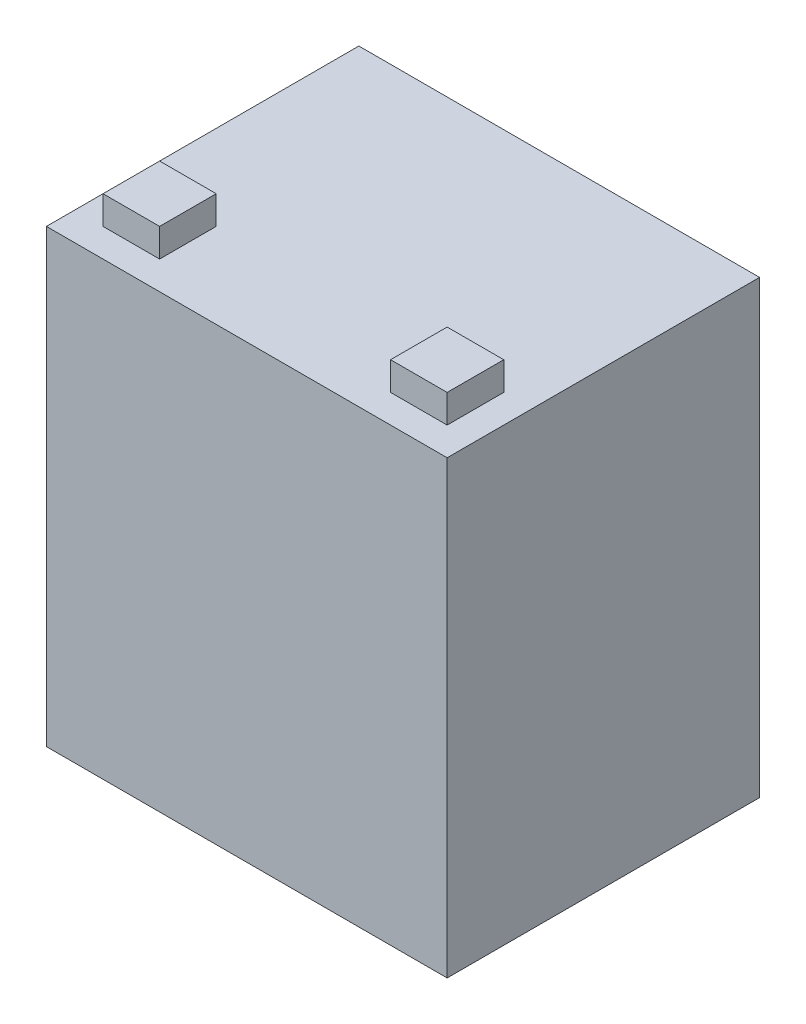
ISO-10303-21;
HEADER;
FILE_DESCRIPTION(('STEP AP214'),'2;1');
FILE_NAME('part.step','',(''),(''),'','','');
FILE_SCHEMA(('AUTOMOTIVE_DESIGN { 1 0 10303 214 1 1 1 1 }'));
ENDSEC;
DATA;
#1=APPLICATION_CONTEXT('core data for automotive mechanical design processes');
#2=APPLICATION_PROTOCOL_DEFINITION('international standard','automotive_design',2000,#1);
#3=PRODUCT_CONTEXT('',#1,'mechanical');
#4=PRODUCT('Part','Part','',(#3));
#5=PRODUCT_RELATED_PRODUCT_CATEGORY('part','',(#4));
#6=PRODUCT_DEFINITION_FORMATION('','',#4);
#7=PRODUCT_DEFINITION_CONTEXT('part definition',#1,'design');
#8=PRODUCT_DEFINITION('design','',#6,#7);
#9=PRODUCT_DEFINITION_SHAPE('','',#8);
#10=(LENGTH_UNIT() NAMED_UNIT(*) SI_UNIT(.MILLI.,.METRE.));
#11=(NAMED_UNIT(*) PLANE_ANGLE_UNIT() SI_UNIT($,.RADIAN.));
#12=(NAMED_UNIT(*) SI_UNIT($,.STERADIAN.) SOLID_ANGLE_UNIT());
#13=UNCERTAINTY_MEASURE_WITH_UNIT(LENGTH_MEASURE(1.E-05),#10,'distance_accuracy_value','');
#14=(GEOMETRIC_REPRESENTATION_CONTEXT(3) GLOBAL_UNCERTAINTY_ASSIGNED_CONTEXT((#13)) GLOBAL_UNIT_ASSIGNED_CONTEXT((#10,
#11,#12)) REPRESENTATION_CONTEXT('',''));
#15=CARTESIAN_POINT('',(0.,0.,0.));
#16=DIRECTION('',(0.,0.,1.));
#17=DIRECTION('',(1.,0.,0.));
#18=AXIS2_PLACEMENT_3D('',#15,#16,#17);
#19=CARTESIAN_POINT('',(0.,101.092,0.));
#20=DIRECTION('',(0.,-1.,0.));
#21=DIRECTION('',(0.,0.,-1.));
#22=AXIS2_PLACEMENT_3D('',#19,#20,#21);
#23=PLANE('',#22);
#24=DIRECTION('',(0.,0.,-1.));
#25=VECTOR('',#24,1.);
#26=CARTESIAN_POINT('',(-25.908,101.092,28.702));
#27=LINE('',#26,#25);
#28=CARTESIAN_POINT('',(-25.908,101.092,28.702));
#29=VERTEX_POINT('',#28);
#30=CARTESIAN_POINT('',(-25.908,101.092,16.002));
#31=VERTEX_POINT('',#30);
#32=EDGE_CURVE('E143',#29,#31,#27,.T.);
#33=ORIENTED_EDGE('',*,*,#32,.F.);
#34=DIRECTION('',(1.,0.,0.));
#35=VECTOR('',#34,1.);
#36=CARTESIAN_POINT('',(-38.608,101.092,28.702));
#37=LINE('',#36,#35);
#38=CARTESIAN_POINT('',(-38.608,101.092,28.702));
#39=VERTEX_POINT('',#38);
#40=EDGE_CURVE('E156',#39,#29,#37,.T.);
#41=ORIENTED_EDGE('',*,*,#40,.F.);
#42=DIRECTION('',(0.,0.,1.));
#43=VECTOR('',#42,1.);
#44=CARTESIAN_POINT('',(-38.608,101.092,28.702));
#45=LINE('',#44,#43);
#46=CARTESIAN_POINT('',(-38.608,101.092,16.002));
#47=VERTEX_POINT('',#46);
#48=EDGE_CURVE('E165',#47,#39,#45,.T.);
#49=ORIENTED_EDGE('',*,*,#48,.F.);
#50=DIRECTION('',(-1.,0.,0.));
#51=VECTOR('',#50,1.);
#52=CARTESIAN_POINT('',(-38.608,101.092,16.002));
#53=LINE('',#52,#51);
#54=EDGE_CURVE('E146',#31,#47,#53,.T.);
#55=ORIENTED_EDGE('',*,*,#54,.F.);
#56=EDGE_LOOP('',(#33,#41,#49,#55));
#57=FACE_BOUND('',#56,.T.);
#58=DIRECTION('',(0.,0.,-1.));
#59=VECTOR('',#58,1.);
#60=CARTESIAN_POINT('',(44.958,101.092,35.052));
#61=LINE('',#60,#59);
#62=CARTESIAN_POINT('',(44.958,101.092,35.052));
#63=VERTEX_POINT('',#62);
#64=CARTESIAN_POINT('',(44.958,101.092,-35.052));
#65=VERTEX_POINT('',#64);
#66=EDGE_CURVE('E182',#63,#65,#61,.T.);
#67=ORIENTED_EDGE('',*,*,#66,.T.);
#68=DIRECTION('',(-1.,0.,0.));
#69=VECTOR('',#68,1.);
#70=CARTESIAN_POINT('',(-44.958,101.092,-35.052));
#71=LINE('',#70,#69);
#72=CARTESIAN_POINT('',(-44.958,101.092,-35.052));
#73=VERTEX_POINT('',#72);
#74=EDGE_CURVE('E185',#65,#73,#71,.T.);
#75=ORIENTED_EDGE('',*,*,#74,.T.);
#76=DIRECTION('',(0.,0.,1.));
#77=VECTOR('',#76,1.);
#78=CARTESIAN_POINT('',(-44.958,101.092,35.052));
#79=LINE('',#78,#77);
#80=CARTESIAN_POINT('',(-44.958,101.092,35.052));
#81=VERTEX_POINT('',#80);
#82=EDGE_CURVE('E188',#73,#81,#79,.T.);
#83=ORIENTED_EDGE('',*,*,#82,.T.);
#84=DIRECTION('',(1.,0.,0.));
#85=VECTOR('',#84,1.);
#86=CARTESIAN_POINT('',(-44.958,101.092,35.052));
#87=LINE('',#86,#85);
#88=EDGE_CURVE('E190',#81,#63,#87,.T.);
#89=ORIENTED_EDGE('',*,*,#88,.T.);
#90=EDGE_LOOP('',(#67,#75,#83,#89));
#91=FACE_BOUND('',#90,.T.);
#92=DIRECTION('',(-1.,0.,0.));
#93=VECTOR('',#92,1.);
#94=CARTESIAN_POINT('',(38.608,101.092,16.0019999999999));
#95=LINE('',#94,#93);
#96=CARTESIAN_POINT('',(38.608,101.092,16.0019999999999));
#97=VERTEX_POINT('',#96);
#98=CARTESIAN_POINT('',(25.908,101.092,16.0019999999999));
#99=VERTEX_POINT('',#98);
#100=EDGE_CURVE('E142',#97,#99,#95,.T.);
#101=ORIENTED_EDGE('',*,*,#100,.F.);
#102=DIRECTION('',(0.,0.,-1.));
#103=VECTOR('',#102,1.);
#104=CARTESIAN_POINT('',(38.608,101.092,28.7019999999999));
#105=LINE('',#104,#103);
#106=CARTESIAN_POINT('',(38.608,101.092,28.7019999999999));
#107=VERTEX_POINT('',#106);
#108=EDGE_CURVE('E139',#107,#97,#105,.T.);
#109=ORIENTED_EDGE('',*,*,#108,.F.);
#110=DIRECTION('',(1.,0.,0.));
#111=VECTOR('',#110,1.);
#112=CARTESIAN_POINT('',(38.608,101.092,28.7019999999999));
#113=LINE('',#112,#111);
#114=CARTESIAN_POINT('',(25.908,101.092,28.7019999999999));
#115=VERTEX_POINT('',#114);
#116=EDGE_CURVE('E53',#115,#107,#113,.T.);
#117=ORIENTED_EDGE('',*,*,#116,.F.);
#118=DIRECTION('',(0.,0.,1.));
#119=VECTOR('',#118,1.);
#120=CARTESIAN_POINT('',(25.908,101.092,28.7019999999999));
#121=LINE('',#120,#119);
#122=EDGE_CURVE('E48',#99,#115,#121,.T.);
#123=ORIENTED_EDGE('',*,*,#122,.F.);
#124=EDGE_LOOP('',(#101,#109,#117,#123));
#125=FACE_BOUND('',#124,.T.);
#126=ADVANCED_FACE('F33',(#57,#91,#125),#23,.F.);
#127=CARTESIAN_POINT('',(44.958,101.092,35.052));
#128=DIRECTION('',(-1.,0.,0.));
#129=DIRECTION('',(0.,0.,1.));
#130=AXIS2_PLACEMENT_3D('',#127,#128,#129);
#131=PLANE('',#130);
#132=DIRECTION('',(0.,0.,-1.));
#133=VECTOR('',#132,1.);
#134=CARTESIAN_POINT('',(44.958,0.,35.052));
#135=LINE('',#134,#133);
#136=CARTESIAN_POINT('',(44.958,0.,35.052));
#137=VERTEX_POINT('',#136);
#138=CARTESIAN_POINT('',(44.958,0.,-35.052));
#139=VERTEX_POINT('',#138);
#140=EDGE_CURVE('E181',#137,#139,#135,.T.);
#141=ORIENTED_EDGE('',*,*,#140,.T.);
#142=DIRECTION('',(0.,-1.,0.));
#143=VECTOR('',#142,1.);
#144=CARTESIAN_POINT('',(44.958,101.092,-35.052));
#145=LINE('',#144,#143);
#146=EDGE_CURVE('E11',#65,#139,#145,.T.);
#147=ORIENTED_EDGE('',*,*,#146,.F.);
#148=ORIENTED_EDGE('',*,*,#66,.F.);
#149=DIRECTION('',(0.,-1.,0.));
#150=VECTOR('',#149,1.);
#151=CARTESIAN_POINT('',(44.958,101.092,35.052));
#152=LINE('',#151,#150);
#153=EDGE_CURVE('E192',#63,#137,#152,.T.);
#154=ORIENTED_EDGE('',*,*,#153,.T.);
#155=EDGE_LOOP('',(#141,#147,#148,#154));
#156=FACE_BOUND('',#155,.T.);
#157=ADVANCED_FACE('F35',(#156),#131,.F.);
#158=CARTESIAN_POINT('',(-44.958,101.092,-35.052));
#159=DIRECTION('',(0.,0.,1.));
#160=DIRECTION('',(1.,0.,0.));
#161=AXIS2_PLACEMENT_3D('',#158,#159,#160);
#162=PLANE('',#161);
#163=DIRECTION('',(-1.,0.,0.));
#164=VECTOR('',#163,1.);
#165=CARTESIAN_POINT('',(-44.958,0.,-35.052));
#166=LINE('',#165,#164);
#167=CARTESIAN_POINT('',(-44.958,0.,-35.052));
#168=VERTEX_POINT('',#167);
#169=EDGE_CURVE('E195',#139,#168,#166,.T.);
#170=ORIENTED_EDGE('',*,*,#169,.T.);
#171=DIRECTION('',(0.,-1.,0.));
#172=VECTOR('',#171,1.);
#173=CARTESIAN_POINT('',(-44.958,101.092,-35.052));
#174=LINE('',#173,#172);
#175=EDGE_CURVE('E41',#73,#168,#174,.T.);
#176=ORIENTED_EDGE('',*,*,#175,.F.);
#177=ORIENTED_EDGE('',*,*,#74,.F.);
#178=ORIENTED_EDGE('',*,*,#146,.T.);
#179=EDGE_LOOP('',(#170,#176,#177,#178));
#180=FACE_BOUND('',#179,.T.);
#181=ADVANCED_FACE('F224',(#180),#162,.F.);
#182=CARTESIAN_POINT('',(-44.958,101.092,35.052));
#183=DIRECTION('',(1.,0.,0.));
#184=DIRECTION('',(0.,0.,-1.));
#185=AXIS2_PLACEMENT_3D('',#182,#183,#184);
#186=PLANE('',#185);
#187=DIRECTION('',(0.,0.,1.));
#188=VECTOR('',#187,1.);
#189=CARTESIAN_POINT('',(-44.958,0.,35.052));
#190=LINE('',#189,#188);
#191=CARTESIAN_POINT('',(-44.958,0.,35.052));
#192=VERTEX_POINT('',#191);
#193=EDGE_CURVE('E197',#168,#192,#190,.T.);
#194=ORIENTED_EDGE('',*,*,#193,.T.);
#195=DIRECTION('',(0.,-1.,0.));
#196=VECTOR('',#195,1.);
#197=CARTESIAN_POINT('',(-44.958,101.092,35.052));
#198=LINE('',#197,#196);
#199=EDGE_CURVE('E202',#81,#192,#198,.T.);
#200=ORIENTED_EDGE('',*,*,#199,.F.);
#201=ORIENTED_EDGE('',*,*,#82,.F.);
#202=ORIENTED_EDGE('',*,*,#175,.T.);
#203=EDGE_LOOP('',(#194,#200,#201,#202));
#204=FACE_BOUND('',#203,.T.);
#205=ADVANCED_FACE('F209',(#204),#186,.F.);
#206=CARTESIAN_POINT('',(-44.958,101.092,35.052));
#207=DIRECTION('',(0.,0.,-1.));
#208=DIRECTION('',(-1.,0.,0.));
#209=AXIS2_PLACEMENT_3D('',#206,#207,#208);
#210=PLANE('',#209);
#211=DIRECTION('',(1.,0.,0.));
#212=VECTOR('',#211,1.);
#213=CARTESIAN_POINT('',(-44.958,0.,35.052));
#214=LINE('',#213,#212);
#215=EDGE_CURVE('E186',#192,#137,#214,.T.);
#216=ORIENTED_EDGE('',*,*,#215,.T.);
#217=ORIENTED_EDGE('',*,*,#153,.F.);
#218=ORIENTED_EDGE('',*,*,#88,.F.);
#219=ORIENTED_EDGE('',*,*,#199,.T.);
#220=EDGE_LOOP('',(#216,#217,#218,#219));
#221=FACE_BOUND('',#220,.T.);
#222=ADVANCED_FACE('F218',(#221),#210,.F.);
#223=CARTESIAN_POINT('',(0.,0.,0.));
#224=DIRECTION('',(0.,-1.,0.));
#225=DIRECTION('',(0.,0.,-1.));
#226=AXIS2_PLACEMENT_3D('',#223,#224,#225);
#227=PLANE('',#226);
#228=ORIENTED_EDGE('',*,*,#140,.F.);
#229=ORIENTED_EDGE('',*,*,#215,.F.);
#230=ORIENTED_EDGE('',*,*,#193,.F.);
#231=ORIENTED_EDGE('',*,*,#169,.F.);
#232=EDGE_LOOP('',(#228,#229,#230,#231));
#233=FACE_BOUND('',#232,.T.);
#234=ADVANCED_FACE('F215',(#233),#227,.T.);
#235=CARTESIAN_POINT('',(-25.908,107.442,28.702));
#236=DIRECTION('',(-1.,0.,0.));
#237=DIRECTION('',(0.,0.,1.));
#238=AXIS2_PLACEMENT_3D('',#235,#236,#237);
#239=PLANE('',#238);
#240=ORIENTED_EDGE('',*,*,#32,.T.);
#241=DIRECTION('',(0.,-1.,0.));
#242=VECTOR('',#241,1.);
#243=CARTESIAN_POINT('',(-25.908,107.442,16.002));
#244=LINE('',#243,#242);
#245=CARTESIAN_POINT('',(-25.908,107.442,16.002));
#246=VERTEX_POINT('',#245);
#247=EDGE_CURVE('E178',#246,#31,#244,.T.);
#248=ORIENTED_EDGE('',*,*,#247,.F.);
#249=DIRECTION('',(0.,0.,-1.));
#250=VECTOR('',#249,1.);
#251=CARTESIAN_POINT('',(-25.908,107.442,28.702));
#252=LINE('',#251,#250);
#253=CARTESIAN_POINT('',(-25.908,107.442,28.702));
#254=VERTEX_POINT('',#253);
#255=EDGE_CURVE('E152',#254,#246,#252,.T.);
#256=ORIENTED_EDGE('',*,*,#255,.F.);
#257=DIRECTION('',(0.,-1.,0.));
#258=VECTOR('',#257,1.);
#259=CARTESIAN_POINT('',(-25.908,107.442,28.702));
#260=LINE('',#259,#258);
#261=EDGE_CURVE('E161',#254,#29,#260,.T.);
#262=ORIENTED_EDGE('',*,*,#261,.T.);
#263=EDGE_LOOP('',(#240,#248,#256,#262));
#264=FACE_BOUND('',#263,.T.);
#265=ADVANCED_FACE('F238',(#264),#239,.F.);
#266=CARTESIAN_POINT('',(-38.608,107.442,16.002));
#267=DIRECTION('',(0.,0.,1.));
#268=DIRECTION('',(1.,0.,0.));
#269=AXIS2_PLACEMENT_3D('',#266,#267,#268);
#270=PLANE('',#269);
#271=ORIENTED_EDGE('',*,*,#54,.T.);
#272=DIRECTION('',(0.,-1.,0.));
#273=VECTOR('',#272,1.);
#274=CARTESIAN_POINT('',(-38.608,107.442,16.002));
#275=LINE('',#274,#273);
#276=CARTESIAN_POINT('',(-38.608,107.442,16.002));
#277=VERTEX_POINT('',#276);
#278=EDGE_CURVE('E175',#277,#47,#275,.T.);
#279=ORIENTED_EDGE('',*,*,#278,.F.);
#280=DIRECTION('',(-1.,0.,0.));
#281=VECTOR('',#280,1.);
#282=CARTESIAN_POINT('',(-38.608,107.442,16.002));
#283=LINE('',#282,#281);
#284=EDGE_CURVE('E155',#246,#277,#283,.T.);
#285=ORIENTED_EDGE('',*,*,#284,.F.);
#286=ORIENTED_EDGE('',*,*,#247,.T.);
#287=EDGE_LOOP('',(#271,#279,#285,#286));
#288=FACE_BOUND('',#287,.T.);
#289=ADVANCED_FACE('F257',(#288),#270,.F.);
#290=CARTESIAN_POINT('',(-38.608,107.442,28.702));
#291=DIRECTION('',(1.,0.,0.));
#292=DIRECTION('',(0.,0.,-1.));
#293=AXIS2_PLACEMENT_3D('',#290,#291,#292);
#294=PLANE('',#293);
#295=ORIENTED_EDGE('',*,*,#48,.T.);
#296=DIRECTION('',(0.,-1.,0.));
#297=VECTOR('',#296,1.);
#298=CARTESIAN_POINT('',(-38.608,107.442,28.702));
#299=LINE('',#298,#297);
#300=CARTESIAN_POINT('',(-38.608,107.442,28.702));
#301=VERTEX_POINT('',#300);
#302=EDGE_CURVE('E172',#301,#39,#299,.T.);
#303=ORIENTED_EDGE('',*,*,#302,.F.);
#304=DIRECTION('',(0.,0.,1.));
#305=VECTOR('',#304,1.);
#306=CARTESIAN_POINT('',(-38.608,107.442,28.702));
#307=LINE('',#306,#305);
#308=EDGE_CURVE('E158',#277,#301,#307,.T.);
#309=ORIENTED_EDGE('',*,*,#308,.F.);
#310=ORIENTED_EDGE('',*,*,#278,.T.);
#311=EDGE_LOOP('',(#295,#303,#309,#310));
#312=FACE_BOUND('',#311,.T.);
#313=ADVANCED_FACE('F264',(#312),#294,.F.);
#314=CARTESIAN_POINT('',(-38.608,107.442,28.702));
#315=DIRECTION('',(0.,0.,-1.));
#316=DIRECTION('',(-1.,0.,0.));
#317=AXIS2_PLACEMENT_3D('',#314,#315,#316);
#318=PLANE('',#317);
#319=ORIENTED_EDGE('',*,*,#40,.T.);
#320=ORIENTED_EDGE('',*,*,#261,.F.);
#321=DIRECTION('',(1.,0.,0.));
#322=VECTOR('',#321,1.);
#323=CARTESIAN_POINT('',(-38.608,107.442,28.702));
#324=LINE('',#323,#322);
#325=EDGE_CURVE('E160',#301,#254,#324,.T.);
#326=ORIENTED_EDGE('',*,*,#325,.F.);
#327=ORIENTED_EDGE('',*,*,#302,.T.);
#328=EDGE_LOOP('',(#319,#320,#326,#327));
#329=FACE_BOUND('',#328,.T.);
#330=ADVANCED_FACE('F271',(#329),#318,.F.);
#331=CARTESIAN_POINT('',(0.,107.442,0.));
#332=DIRECTION('',(0.,-1.,0.));
#333=DIRECTION('',(0.,0.,-1.));
#334=AXIS2_PLACEMENT_3D('',#331,#332,#333);
#335=PLANE('',#334);
#336=ORIENTED_EDGE('',*,*,#255,.T.);
#337=ORIENTED_EDGE('',*,*,#284,.T.);
#338=ORIENTED_EDGE('',*,*,#308,.T.);
#339=ORIENTED_EDGE('',*,*,#325,.T.);
#340=EDGE_LOOP('',(#336,#337,#338,#339));
#341=FACE_BOUND('',#340,.T.);
#342=ADVANCED_FACE('F279',(#341),#335,.F.);
#343=CARTESIAN_POINT('',(38.608,107.442,16.0019999999999));
#344=DIRECTION('',(0.,0.,1.));
#345=DIRECTION('',(1.,0.,0.));
#346=AXIS2_PLACEMENT_3D('',#343,#344,#345);
#347=PLANE('',#346);
#348=ORIENTED_EDGE('',*,*,#100,.T.);
#349=DIRECTION('',(0.,-1.,0.));
#350=VECTOR('',#349,1.);
#351=CARTESIAN_POINT('',(25.908,107.442,16.0019999999999));
#352=LINE('',#351,#350);
#353=CARTESIAN_POINT('',(25.908,107.442,16.0019999999999));
#354=VERTEX_POINT('',#353);
#355=EDGE_CURVE('E123',#354,#99,#352,.T.);
#356=ORIENTED_EDGE('',*,*,#355,.F.);
#357=DIRECTION('',(-1.,0.,0.));
#358=VECTOR('',#357,1.);
#359=CARTESIAN_POINT('',(38.608,107.442,16.0019999999999));
#360=LINE('',#359,#358);
#361=CARTESIAN_POINT('',(38.608,107.442,16.0019999999999));
#362=VERTEX_POINT('',#361);
#363=EDGE_CURVE('E130',#362,#354,#360,.T.);
#364=ORIENTED_EDGE('',*,*,#363,.F.);
#365=DIRECTION('',(0.,-1.,0.));
#366=VECTOR('',#365,1.);
#367=CARTESIAN_POINT('',(38.608,107.442,16.0019999999999));
#368=LINE('',#367,#366);
#369=EDGE_CURVE('E368',#362,#97,#368,.T.);
#370=ORIENTED_EDGE('',*,*,#369,.T.);
#371=EDGE_LOOP('',(#348,#356,#364,#370));
#372=FACE_BOUND('',#371,.T.);
#373=ADVANCED_FACE('F141',(#372),#347,.F.);
#374=CARTESIAN_POINT('',(25.908,107.442,28.7019999999999));
#375=DIRECTION('',(1.,0.,0.));
#376=DIRECTION('',(0.,0.,-1.));
#377=AXIS2_PLACEMENT_3D('',#374,#375,#376);
#378=PLANE('',#377);
#379=ORIENTED_EDGE('',*,*,#122,.T.);
#380=DIRECTION('',(0.,-1.,0.));
#381=VECTOR('',#380,1.);
#382=CARTESIAN_POINT('',(25.908,107.442,28.7019999999999));
#383=LINE('',#382,#381);
#384=CARTESIAN_POINT('',(25.908,107.442,28.7019999999999));
#385=VERTEX_POINT('',#384);
#386=EDGE_CURVE('E126',#385,#115,#383,.T.);
#387=ORIENTED_EDGE('',*,*,#386,.F.);
#388=DIRECTION('',(0.,0.,1.));
#389=VECTOR('',#388,1.);
#390=CARTESIAN_POINT('',(25.908,107.442,28.7019999999999));
#391=LINE('',#390,#389);
#392=EDGE_CURVE('E119',#354,#385,#391,.T.);
#393=ORIENTED_EDGE('',*,*,#392,.F.);
#394=ORIENTED_EDGE('',*,*,#355,.T.);
#395=EDGE_LOOP('',(#379,#387,#393,#394));
#396=FACE_BOUND('',#395,.T.);
#397=ADVANCED_FACE('F121',(#396),#378,.F.);
#398=CARTESIAN_POINT('',(38.608,107.442,28.7019999999999));
#399=DIRECTION('',(0.,0.,-1.));
#400=DIRECTION('',(-1.,0.,0.));
#401=AXIS2_PLACEMENT_3D('',#398,#399,#400);
#402=PLANE('',#401);
#403=ORIENTED_EDGE('',*,*,#116,.T.);
#404=DIRECTION('',(0.,-1.,0.));
#405=VECTOR('',#404,1.);
#406=CARTESIAN_POINT('',(38.608,107.442,28.7019999999999));
#407=LINE('',#406,#405);
#408=CARTESIAN_POINT('',(38.608,107.442,28.7019999999999));
#409=VERTEX_POINT('',#408);
#410=EDGE_CURVE('E148',#409,#107,#407,.T.);
#411=ORIENTED_EDGE('',*,*,#410,.F.);
#412=DIRECTION('',(1.,0.,0.));
#413=VECTOR('',#412,1.);
#414=CARTESIAN_POINT('',(38.608,107.442,28.7019999999999));
#415=LINE('',#414,#413);
#416=EDGE_CURVE('E129',#385,#409,#415,.T.);
#417=ORIENTED_EDGE('',*,*,#416,.F.);
#418=ORIENTED_EDGE('',*,*,#386,.T.);
#419=EDGE_LOOP('',(#403,#411,#417,#418));
#420=FACE_BOUND('',#419,.T.);
#421=ADVANCED_FACE('F300',(#420),#402,.F.);
#422=CARTESIAN_POINT('',(38.608,107.442,28.7019999999999));
#423=DIRECTION('',(-1.,0.,0.));
#424=DIRECTION('',(0.,0.,1.));
#425=AXIS2_PLACEMENT_3D('',#422,#423,#424);
#426=PLANE('',#425);
#427=ORIENTED_EDGE('',*,*,#108,.T.);
#428=ORIENTED_EDGE('',*,*,#369,.F.);
#429=DIRECTION('',(0.,0.,-1.));
#430=VECTOR('',#429,1.);
#431=CARTESIAN_POINT('',(38.608,107.442,28.7019999999999));
#432=LINE('',#431,#430);
#433=EDGE_CURVE('E135',#409,#362,#432,.T.);
#434=ORIENTED_EDGE('',*,*,#433,.F.);
#435=ORIENTED_EDGE('',*,*,#410,.T.);
#436=EDGE_LOOP('',(#427,#428,#434,#435));
#437=FACE_BOUND('',#436,.T.);
#438=ADVANCED_FACE('F307',(#437),#426,.F.);
#439=CARTESIAN_POINT('',(0.,107.442,0.));
#440=DIRECTION('',(0.,-1.,0.));
#441=DIRECTION('',(0.,0.,-1.));
#442=AXIS2_PLACEMENT_3D('',#439,#440,#441);
#443=PLANE('',#442);
#444=ORIENTED_EDGE('',*,*,#363,.T.);
#445=ORIENTED_EDGE('',*,*,#392,.T.);
#446=ORIENTED_EDGE('',*,*,#416,.T.);
#447=ORIENTED_EDGE('',*,*,#433,.T.);
#448=EDGE_LOOP('',(#444,#445,#446,#447));
#449=FACE_BOUND('',#448,.T.);
#450=ADVANCED_FACE('F133',(#449),#443,.F.);
#451=CLOSED_SHELL('',(#126,#157,#181,#205,#222,#234,#265,#289,#313,#330,#342,#373,#397,#421,
#438,#450));
#452=MANIFOLD_SOLID_BREP('B2',#451);
#453=ADVANCED_BREP_SHAPE_REPRESENTATION('',(#18,#452),#14);
#454=SHAPE_DEFINITION_REPRESENTATION(#9,#453);
ENDSEC;
END-ISO-10303-21;
